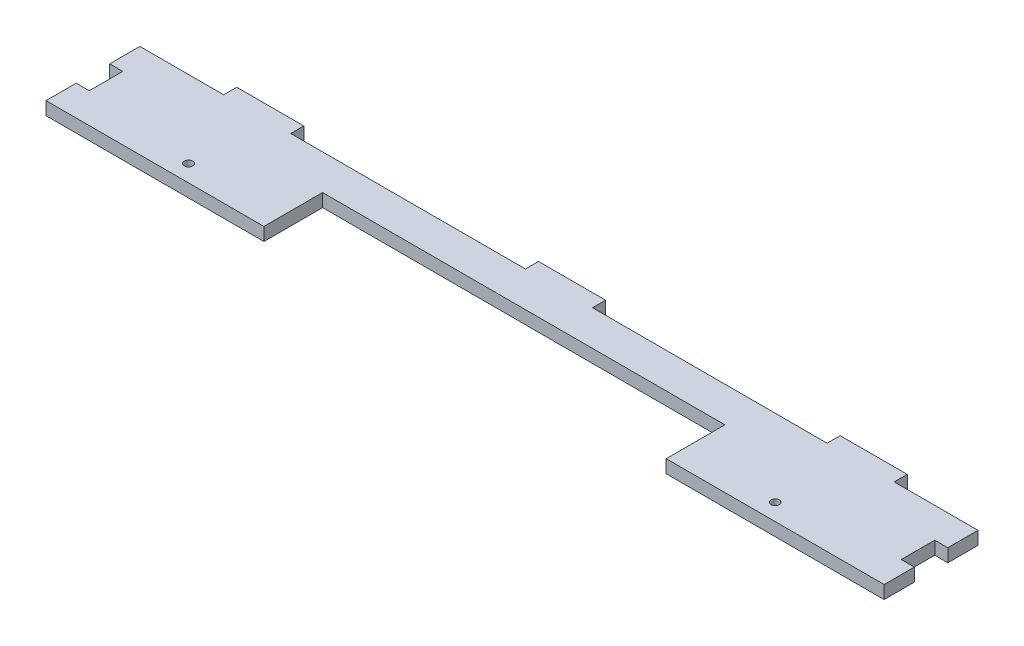
ISO-10303-21;
HEADER;
FILE_DESCRIPTION(('STEP AP214'),'2;1');
FILE_NAME('part.step','',(''),(''),'','','');
FILE_SCHEMA(('AUTOMOTIVE_DESIGN { 1 0 10303 214 1 1 1 1 }'));
ENDSEC;
DATA;
#1=APPLICATION_CONTEXT('core data for automotive mechanical design processes');
#2=APPLICATION_PROTOCOL_DEFINITION('international standard','automotive_design',2000,#1);
#3=PRODUCT_CONTEXT('',#1,'mechanical');
#4=PRODUCT('Part','Part','',(#3));
#5=PRODUCT_RELATED_PRODUCT_CATEGORY('part','',(#4));
#6=PRODUCT_DEFINITION_FORMATION('','',#4);
#7=PRODUCT_DEFINITION_CONTEXT('part definition',#1,'design');
#8=PRODUCT_DEFINITION('design','',#6,#7);
#9=PRODUCT_DEFINITION_SHAPE('','',#8);
#10=(LENGTH_UNIT() NAMED_UNIT(*) SI_UNIT(.MILLI.,.METRE.));
#11=(NAMED_UNIT(*) PLANE_ANGLE_UNIT() SI_UNIT($,.RADIAN.));
#12=(NAMED_UNIT(*) SI_UNIT($,.STERADIAN.) SOLID_ANGLE_UNIT());
#13=UNCERTAINTY_MEASURE_WITH_UNIT(LENGTH_MEASURE(1.E-05),#10,'distance_accuracy_value','');
#14=(GEOMETRIC_REPRESENTATION_CONTEXT(3) GLOBAL_UNCERTAINTY_ASSIGNED_CONTEXT((#13)) GLOBAL_UNIT_ASSIGNED_CONTEXT((#10,
#11,#12)) REPRESENTATION_CONTEXT('',''));
#15=CARTESIAN_POINT('',(0.,0.,0.));
#16=DIRECTION('',(0.,0.,1.));
#17=DIRECTION('',(1.,0.,0.));
#18=AXIS2_PLACEMENT_3D('',#15,#16,#17);
#19=CARTESIAN_POINT('',(60.,3.9,0.));
#20=DIRECTION('',(-1.,0.,0.));
#21=DIRECTION('',(0.,0.,1.));
#22=AXIS2_PLACEMENT_3D('',#19,#20,#21);
#23=PLANE('',#22);
#24=DIRECTION('',(0.,0.,-1.));
#25=VECTOR('',#24,1.);
#26=CARTESIAN_POINT('',(60.,0.,0.));
#27=LINE('',#26,#25);
#28=CARTESIAN_POINT('',(60.,0.,14.));
#29=VERTEX_POINT('',#28);
#30=CARTESIAN_POINT('',(60.,0.,-3.5));
#31=VERTEX_POINT('',#30);
#32=EDGE_CURVE('E270',#29,#31,#27,.T.);
#33=ORIENTED_EDGE('',*,*,#32,.F.);
#34=DIRECTION('',(0.,-1.,0.));
#35=VECTOR('',#34,1.);
#36=CARTESIAN_POINT('',(60.,3.9,14.));
#37=LINE('',#36,#35);
#38=CARTESIAN_POINT('',(60.,3.9,14.));
#39=VERTEX_POINT('',#38);
#40=EDGE_CURVE('E11',#39,#29,#37,.T.);
#41=ORIENTED_EDGE('',*,*,#40,.F.);
#42=DIRECTION('',(0.,0.,-1.));
#43=VECTOR('',#42,1.);
#44=CARTESIAN_POINT('',(60.,3.9,0.));
#45=LINE('',#44,#43);
#46=CARTESIAN_POINT('',(60.,3.9,-3.5));
#47=VERTEX_POINT('',#46);
#48=EDGE_CURVE('E379',#39,#47,#45,.T.);
#49=ORIENTED_EDGE('',*,*,#48,.T.);
#50=DIRECTION('',(0.,-1.,0.));
#51=VECTOR('',#50,1.);
#52=CARTESIAN_POINT('',(60.,3.9,-3.5));
#53=LINE('',#52,#51);
#54=EDGE_CURVE('E153',#47,#31,#53,.T.);
#55=ORIENTED_EDGE('',*,*,#54,.T.);
#56=EDGE_LOOP('',(#33,#41,#49,#55));
#57=FACE_BOUND('',#56,.T.);
#58=ADVANCED_FACE('F41',(#57),#23,.T.);
#59=CARTESIAN_POINT('',(0.,3.9,14.));
#60=DIRECTION('',(0.,0.,-1.));
#61=DIRECTION('',(-1.,0.,0.));
#62=AXIS2_PLACEMENT_3D('',#59,#60,#61);
#63=PLANE('',#62);
#64=DIRECTION('',(1.,0.,0.));
#65=VECTOR('',#64,1.);
#66=CARTESIAN_POINT('',(0.,0.,14.));
#67=LINE('',#66,#65);
#68=CARTESIAN_POINT('',(125.,0.,14.));
#69=VERTEX_POINT('',#68);
#70=EDGE_CURVE('E274',#29,#69,#67,.T.);
#71=ORIENTED_EDGE('',*,*,#70,.T.);
#72=DIRECTION('',(0.,-1.,0.));
#73=VECTOR('',#72,1.);
#74=CARTESIAN_POINT('',(125.,3.9,14.));
#75=LINE('',#74,#73);
#76=CARTESIAN_POINT('',(125.,3.9,14.));
#77=VERTEX_POINT('',#76);
#78=EDGE_CURVE('E50',#77,#69,#75,.T.);
#79=ORIENTED_EDGE('',*,*,#78,.F.);
#80=DIRECTION('',(1.,0.,0.));
#81=VECTOR('',#80,1.);
#82=CARTESIAN_POINT('',(0.,3.9,14.));
#83=LINE('',#82,#81);
#84=EDGE_CURVE('E245',#39,#77,#83,.T.);
#85=ORIENTED_EDGE('',*,*,#84,.F.);
#86=ORIENTED_EDGE('',*,*,#40,.T.);
#87=EDGE_LOOP('',(#71,#79,#85,#86));
#88=FACE_BOUND('',#87,.T.);
#89=ADVANCED_FACE('F464',(#88),#63,.F.);
#90=CARTESIAN_POINT('',(125.,3.9,7.70988211545248E-13));
#91=DIRECTION('',(1.,0.,0.));
#92=DIRECTION('',(0.,0.,-1.));
#93=AXIS2_PLACEMENT_3D('',#90,#91,#92);
#94=PLANE('',#93);
#95=DIRECTION('',(0.,0.,1.));
#96=VECTOR('',#95,1.);
#97=CARTESIAN_POINT('',(125.,0.,7.70988211545248E-13));
#98=LINE('',#97,#96);
#99=CARTESIAN_POINT('',(125.,0.,5.));
#100=VERTEX_POINT('',#99);
#101=EDGE_CURVE('E278',#100,#69,#98,.T.);
#102=ORIENTED_EDGE('',*,*,#101,.F.);
#103=DIRECTION('',(0.,-1.,0.));
#104=VECTOR('',#103,1.);
#105=CARTESIAN_POINT('',(125.,3.9,5.));
#106=LINE('',#105,#104);
#107=CARTESIAN_POINT('',(125.,3.9,5.));
#108=VERTEX_POINT('',#107);
#109=EDGE_CURVE('E452',#108,#100,#106,.T.);
#110=ORIENTED_EDGE('',*,*,#109,.F.);
#111=DIRECTION('',(0.,0.,1.));
#112=VECTOR('',#111,1.);
#113=CARTESIAN_POINT('',(125.,3.9,7.70988211545248E-13));
#114=LINE('',#113,#112);
#115=EDGE_CURVE('E461',#108,#77,#114,.T.);
#116=ORIENTED_EDGE('',*,*,#115,.T.);
#117=ORIENTED_EDGE('',*,*,#78,.T.);
#118=EDGE_LOOP('',(#102,#110,#116,#117));
#119=FACE_BOUND('',#118,.T.);
#120=ADVANCED_FACE('F459',(#119),#94,.T.);
#121=CARTESIAN_POINT('',(0.,3.9,4.99999999999997));
#122=DIRECTION('',(0.,0.,-1.));
#123=DIRECTION('',(-1.,0.,0.));
#124=AXIS2_PLACEMENT_3D('',#121,#122,#123);
#125=PLANE('',#124);
#126=DIRECTION('',(1.,0.,0.));
#127=VECTOR('',#126,1.);
#128=CARTESIAN_POINT('',(0.,0.,4.99999999999997));
#129=LINE('',#128,#127);
#130=CARTESIAN_POINT('',(121.1,0.,5.));
#131=VERTEX_POINT('',#130);
#132=EDGE_CURVE('E282',#131,#100,#129,.T.);
#133=ORIENTED_EDGE('',*,*,#132,.F.);
#134=DIRECTION('',(0.,-1.,0.));
#135=VECTOR('',#134,1.);
#136=CARTESIAN_POINT('',(121.1,3.9,5.));
#137=LINE('',#136,#135);
#138=CARTESIAN_POINT('',(121.1,3.9,5.));
#139=VERTEX_POINT('',#138);
#140=EDGE_CURVE('E449',#139,#131,#137,.T.);
#141=ORIENTED_EDGE('',*,*,#140,.F.);
#142=DIRECTION('',(1.,0.,0.));
#143=VECTOR('',#142,1.);
#144=CARTESIAN_POINT('',(0.,3.9,4.99999999999997));
#145=LINE('',#144,#143);
#146=EDGE_CURVE('E476',#139,#108,#145,.T.);
#147=ORIENTED_EDGE('',*,*,#146,.T.);
#148=ORIENTED_EDGE('',*,*,#109,.T.);
#149=EDGE_LOOP('',(#133,#141,#147,#148));
#150=FACE_BOUND('',#149,.T.);
#151=ADVANCED_FACE('F472',(#150),#125,.T.);
#152=CARTESIAN_POINT('',(121.1,3.9,0.));
#153=DIRECTION('',(-1.,0.,0.));
#154=DIRECTION('',(0.,0.,1.));
#155=AXIS2_PLACEMENT_3D('',#152,#153,#154);
#156=PLANE('',#155);
#157=DIRECTION('',(0.,0.,-1.));
#158=VECTOR('',#157,1.);
#159=CARTESIAN_POINT('',(121.1,0.,0.));
#160=LINE('',#159,#158);
#161=CARTESIAN_POINT('',(121.1,0.,-5.));
#162=VERTEX_POINT('',#161);
#163=EDGE_CURVE('E286',#131,#162,#160,.T.);
#164=ORIENTED_EDGE('',*,*,#163,.T.);
#165=DIRECTION('',(0.,-1.,0.));
#166=VECTOR('',#165,1.);
#167=CARTESIAN_POINT('',(121.1,3.9,-5.));
#168=LINE('',#167,#166);
#169=CARTESIAN_POINT('',(121.1,3.9,-5.));
#170=VERTEX_POINT('',#169);
#171=EDGE_CURVE('E445',#170,#162,#168,.T.);
#172=ORIENTED_EDGE('',*,*,#171,.F.);
#173=DIRECTION('',(0.,0.,-1.));
#174=VECTOR('',#173,1.);
#175=CARTESIAN_POINT('',(121.1,3.9,0.));
#176=LINE('',#175,#174);
#177=EDGE_CURVE('E481',#139,#170,#176,.T.);
#178=ORIENTED_EDGE('',*,*,#177,.F.);
#179=ORIENTED_EDGE('',*,*,#140,.T.);
#180=EDGE_LOOP('',(#164,#172,#178,#179));
#181=FACE_BOUND('',#180,.T.);
#182=ADVANCED_FACE('F660',(#181),#156,.F.);
#183=CARTESIAN_POINT('',(0.,3.9,-5.00000000000003));
#184=DIRECTION('',(0.,0.,-1.));
#185=DIRECTION('',(-1.,0.,0.));
#186=AXIS2_PLACEMENT_3D('',#183,#184,#185);
#187=PLANE('',#186);
#188=DIRECTION('',(1.,0.,0.));
#189=VECTOR('',#188,1.);
#190=CARTESIAN_POINT('',(0.,0.,-5.00000000000003));
#191=LINE('',#190,#189);
#192=CARTESIAN_POINT('',(125.,0.,-5.));
#193=VERTEX_POINT('',#192);
#194=EDGE_CURVE('E289',#162,#193,#191,.T.);
#195=ORIENTED_EDGE('',*,*,#194,.T.);
#196=DIRECTION('',(0.,-1.,0.));
#197=VECTOR('',#196,1.);
#198=CARTESIAN_POINT('',(125.,3.9,-5.));
#199=LINE('',#198,#197);
#200=CARTESIAN_POINT('',(125.,3.9,-5.));
#201=VERTEX_POINT('',#200);
#202=EDGE_CURVE('E442',#201,#193,#199,.T.);
#203=ORIENTED_EDGE('',*,*,#202,.F.);
#204=DIRECTION('',(1.,0.,0.));
#205=VECTOR('',#204,1.);
#206=CARTESIAN_POINT('',(0.,3.9,-5.00000000000003));
#207=LINE('',#206,#205);
#208=EDGE_CURVE('E487',#170,#201,#207,.T.);
#209=ORIENTED_EDGE('',*,*,#208,.F.);
#210=ORIENTED_EDGE('',*,*,#171,.T.);
#211=EDGE_LOOP('',(#195,#203,#209,#210));
#212=FACE_BOUND('',#211,.T.);
#213=ADVANCED_FACE('F656',(#212),#187,.F.);
#214=CARTESIAN_POINT('',(125.,3.9,-7.70988211545248E-13));
#215=DIRECTION('',(1.,0.,0.));
#216=DIRECTION('',(0.,0.,-1.));
#217=AXIS2_PLACEMENT_3D('',#214,#215,#216);
#218=PLANE('',#217);
#219=DIRECTION('',(0.,0.,1.));
#220=VECTOR('',#219,1.);
#221=CARTESIAN_POINT('',(125.,0.,-7.70988211545248E-13));
#222=LINE('',#221,#220);
#223=CARTESIAN_POINT('',(125.,0.,-14.));
#224=VERTEX_POINT('',#223);
#225=EDGE_CURVE('E293',#224,#193,#222,.T.);
#226=ORIENTED_EDGE('',*,*,#225,.F.);
#227=DIRECTION('',(0.,-1.,0.));
#228=VECTOR('',#227,1.);
#229=CARTESIAN_POINT('',(125.,3.9,-14.));
#230=LINE('',#229,#228);
#231=CARTESIAN_POINT('',(125.,3.9,-14.));
#232=VERTEX_POINT('',#231);
#233=EDGE_CURVE('E439',#232,#224,#230,.T.);
#234=ORIENTED_EDGE('',*,*,#233,.F.);
#235=DIRECTION('',(0.,0.,1.));
#236=VECTOR('',#235,1.);
#237=CARTESIAN_POINT('',(125.,3.9,-7.70988211545248E-13));
#238=LINE('',#237,#236);
#239=EDGE_CURVE('E490',#232,#201,#238,.T.);
#240=ORIENTED_EDGE('',*,*,#239,.T.);
#241=ORIENTED_EDGE('',*,*,#202,.T.);
#242=EDGE_LOOP('',(#226,#234,#240,#241));
#243=FACE_BOUND('',#242,.T.);
#244=ADVANCED_FACE('F652',(#243),#218,.T.);
#245=CARTESIAN_POINT('',(0.,3.9,-14.));
#246=DIRECTION('',(0.,0.,-1.));
#247=DIRECTION('',(-1.,0.,0.));
#248=AXIS2_PLACEMENT_3D('',#245,#246,#247);
#249=PLANE('',#248);
#250=DIRECTION('',(1.,0.,0.));
#251=VECTOR('',#250,1.);
#252=CARTESIAN_POINT('',(0.,0.,-14.));
#253=LINE('',#252,#251);
#254=CARTESIAN_POINT('',(100.,0.,-14.));
#255=VERTEX_POINT('',#254);
#256=EDGE_CURVE('E297',#255,#224,#253,.T.);
#257=ORIENTED_EDGE('',*,*,#256,.F.);
#258=DIRECTION('',(0.,-1.,0.));
#259=VECTOR('',#258,1.);
#260=CARTESIAN_POINT('',(100.,3.9,-14.));
#261=LINE('',#260,#259);
#262=CARTESIAN_POINT('',(100.,3.9,-14.));
#263=VERTEX_POINT('',#262);
#264=EDGE_CURVE('E436',#263,#255,#261,.T.);
#265=ORIENTED_EDGE('',*,*,#264,.F.);
#266=DIRECTION('',(1.,0.,0.));
#267=VECTOR('',#266,1.);
#268=CARTESIAN_POINT('',(0.,3.9,-14.));
#269=LINE('',#268,#267);
#270=EDGE_CURVE('E494',#263,#232,#269,.T.);
#271=ORIENTED_EDGE('',*,*,#270,.T.);
#272=ORIENTED_EDGE('',*,*,#233,.T.);
#273=EDGE_LOOP('',(#257,#265,#271,#272));
#274=FACE_BOUND('',#273,.T.);
#275=ADVANCED_FACE('F648',(#274),#249,.T.);
#276=CARTESIAN_POINT('',(100.,3.9,0.));
#277=DIRECTION('',(-1.,0.,0.));
#278=DIRECTION('',(0.,0.,1.));
#279=AXIS2_PLACEMENT_3D('',#276,#277,#278);
#280=PLANE('',#279);
#281=DIRECTION('',(0.,0.,-1.));
#282=VECTOR('',#281,1.);
#283=CARTESIAN_POINT('',(100.,0.,0.));
#284=LINE('',#283,#282);
#285=CARTESIAN_POINT('',(100.,0.,-17.9));
#286=VERTEX_POINT('',#285);
#287=EDGE_CURVE('E301',#255,#286,#284,.T.);
#288=ORIENTED_EDGE('',*,*,#287,.T.);
#289=DIRECTION('',(0.,-1.,0.));
#290=VECTOR('',#289,1.);
#291=CARTESIAN_POINT('',(100.,3.9,-17.9));
#292=LINE('',#291,#290);
#293=CARTESIAN_POINT('',(100.,3.9,-17.9));
#294=VERTEX_POINT('',#293);
#295=EDGE_CURVE('E432',#294,#286,#292,.T.);
#296=ORIENTED_EDGE('',*,*,#295,.F.);
#297=DIRECTION('',(0.,0.,-1.));
#298=VECTOR('',#297,1.);
#299=CARTESIAN_POINT('',(100.,3.9,0.));
#300=LINE('',#299,#298);
#301=EDGE_CURVE('E498',#263,#294,#300,.T.);
#302=ORIENTED_EDGE('',*,*,#301,.F.);
#303=ORIENTED_EDGE('',*,*,#264,.T.);
#304=EDGE_LOOP('',(#288,#296,#302,#303));
#305=FACE_BOUND('',#304,.T.);
#306=ADVANCED_FACE('F644',(#305),#280,.F.);
#307=CARTESIAN_POINT('',(0.,3.9,-17.9));
#308=DIRECTION('',(0.,0.,1.));
#309=DIRECTION('',(1.,0.,0.));
#310=AXIS2_PLACEMENT_3D('',#307,#308,#309);
#311=PLANE('',#310);
#312=DIRECTION('',(-1.,0.,0.));
#313=VECTOR('',#312,1.);
#314=CARTESIAN_POINT('',(0.,0.,-17.9));
#315=LINE('',#314,#313);
#316=CARTESIAN_POINT('',(80.,0.,-17.9));
#317=VERTEX_POINT('',#316);
#318=EDGE_CURVE('E304',#286,#317,#315,.T.);
#319=ORIENTED_EDGE('',*,*,#318,.T.);
#320=DIRECTION('',(0.,-1.,0.));
#321=VECTOR('',#320,1.);
#322=CARTESIAN_POINT('',(80.,3.9,-17.9));
#323=LINE('',#322,#321);
#324=CARTESIAN_POINT('',(80.,3.9,-17.9));
#325=VERTEX_POINT('',#324);
#326=EDGE_CURVE('E429',#325,#317,#323,.T.);
#327=ORIENTED_EDGE('',*,*,#326,.F.);
#328=DIRECTION('',(-1.,0.,0.));
#329=VECTOR('',#328,1.);
#330=CARTESIAN_POINT('',(0.,3.9,-17.9));
#331=LINE('',#330,#329);
#332=EDGE_CURVE('E501',#294,#325,#331,.T.);
#333=ORIENTED_EDGE('',*,*,#332,.F.);
#334=ORIENTED_EDGE('',*,*,#295,.T.);
#335=EDGE_LOOP('',(#319,#327,#333,#334));
#336=FACE_BOUND('',#335,.T.);
#337=ADVANCED_FACE('F640',(#336),#311,.F.);
#338=CARTESIAN_POINT('',(80.,3.9,0.));
#339=DIRECTION('',(-1.,0.,0.));
#340=DIRECTION('',(0.,0.,1.));
#341=AXIS2_PLACEMENT_3D('',#338,#339,#340);
#342=PLANE('',#341);
#343=DIRECTION('',(0.,0.,-1.));
#344=VECTOR('',#343,1.);
#345=CARTESIAN_POINT('',(80.,0.,0.));
#346=LINE('',#345,#344);
#347=CARTESIAN_POINT('',(80.,0.,-14.));
#348=VERTEX_POINT('',#347);
#349=EDGE_CURVE('E308',#348,#317,#346,.T.);
#350=ORIENTED_EDGE('',*,*,#349,.F.);
#351=DIRECTION('',(0.,-1.,0.));
#352=VECTOR('',#351,1.);
#353=CARTESIAN_POINT('',(80.,3.9,-14.));
#354=LINE('',#353,#352);
#355=CARTESIAN_POINT('',(80.,3.9,-14.));
#356=VERTEX_POINT('',#355);
#357=EDGE_CURVE('E426',#356,#348,#354,.T.);
#358=ORIENTED_EDGE('',*,*,#357,.F.);
#359=DIRECTION('',(0.,0.,-1.));
#360=VECTOR('',#359,1.);
#361=CARTESIAN_POINT('',(80.,3.9,0.));
#362=LINE('',#361,#360);
#363=EDGE_CURVE('E504',#356,#325,#362,.T.);
#364=ORIENTED_EDGE('',*,*,#363,.T.);
#365=ORIENTED_EDGE('',*,*,#326,.T.);
#366=EDGE_LOOP('',(#350,#358,#364,#365));
#367=FACE_BOUND('',#366,.T.);
#368=ADVANCED_FACE('F636',(#367),#342,.T.);
#369=CARTESIAN_POINT('',(0.,3.9,-14.));
#370=DIRECTION('',(0.,0.,-1.));
#371=DIRECTION('',(-1.,0.,0.));
#372=AXIS2_PLACEMENT_3D('',#369,#370,#371);
#373=PLANE('',#372);
#374=DIRECTION('',(1.,0.,0.));
#375=VECTOR('',#374,1.);
#376=CARTESIAN_POINT('',(0.,0.,-14.));
#377=LINE('',#376,#375);
#378=CARTESIAN_POINT('',(10.,0.,-14.));
#379=VERTEX_POINT('',#378);
#380=EDGE_CURVE('E312',#379,#348,#377,.T.);
#381=ORIENTED_EDGE('',*,*,#380,.F.);
#382=DIRECTION('',(0.,-1.,0.));
#383=VECTOR('',#382,1.);
#384=CARTESIAN_POINT('',(10.,3.9,-14.));
#385=LINE('',#384,#383);
#386=CARTESIAN_POINT('',(10.,3.9,-14.));
#387=VERTEX_POINT('',#386);
#388=EDGE_CURVE('E423',#387,#379,#385,.T.);
#389=ORIENTED_EDGE('',*,*,#388,.F.);
#390=DIRECTION('',(1.,0.,0.));
#391=VECTOR('',#390,1.);
#392=CARTESIAN_POINT('',(0.,3.9,-14.));
#393=LINE('',#392,#391);
#394=EDGE_CURVE('E508',#387,#356,#393,.T.);
#395=ORIENTED_EDGE('',*,*,#394,.T.);
#396=ORIENTED_EDGE('',*,*,#357,.T.);
#397=EDGE_LOOP('',(#381,#389,#395,#396));
#398=FACE_BOUND('',#397,.T.);
#399=ADVANCED_FACE('F632',(#398),#373,.T.);
#400=CARTESIAN_POINT('',(10.,3.9,0.));
#401=DIRECTION('',(1.,0.,0.));
#402=DIRECTION('',(0.,0.,-1.));
#403=AXIS2_PLACEMENT_3D('',#400,#401,#402);
#404=PLANE('',#403);
#405=DIRECTION('',(0.,0.,1.));
#406=VECTOR('',#405,1.);
#407=CARTESIAN_POINT('',(10.,0.,0.));
#408=LINE('',#407,#406);
#409=CARTESIAN_POINT('',(10.,0.,-17.9));
#410=VERTEX_POINT('',#409);
#411=EDGE_CURVE('E316',#410,#379,#408,.T.);
#412=ORIENTED_EDGE('',*,*,#411,.F.);
#413=DIRECTION('',(0.,-1.,0.));
#414=VECTOR('',#413,1.);
#415=CARTESIAN_POINT('',(10.,3.9,-17.9));
#416=LINE('',#415,#414);
#417=CARTESIAN_POINT('',(10.,3.9,-17.9));
#418=VERTEX_POINT('',#417);
#419=EDGE_CURVE('E420',#418,#410,#416,.T.);
#420=ORIENTED_EDGE('',*,*,#419,.F.);
#421=DIRECTION('',(0.,0.,1.));
#422=VECTOR('',#421,1.);
#423=CARTESIAN_POINT('',(10.,3.9,0.));
#424=LINE('',#423,#422);
#425=EDGE_CURVE('E512',#418,#387,#424,.T.);
#426=ORIENTED_EDGE('',*,*,#425,.T.);
#427=ORIENTED_EDGE('',*,*,#388,.T.);
#428=EDGE_LOOP('',(#412,#420,#426,#427));
#429=FACE_BOUND('',#428,.T.);
#430=ADVANCED_FACE('F628',(#429),#404,.T.);
#431=CARTESIAN_POINT('',(0.,3.9,-17.9));
#432=DIRECTION('',(0.,0.,-1.));
#433=DIRECTION('',(-1.,0.,0.));
#434=AXIS2_PLACEMENT_3D('',#431,#432,#433);
#435=PLANE('',#434);
#436=DIRECTION('',(1.,0.,0.));
#437=VECTOR('',#436,1.);
#438=CARTESIAN_POINT('',(0.,0.,-17.9));
#439=LINE('',#438,#437);
#440=CARTESIAN_POINT('',(-10.,0.,-17.9));
#441=VERTEX_POINT('',#440);
#442=EDGE_CURVE('E320',#441,#410,#439,.T.);
#443=ORIENTED_EDGE('',*,*,#442,.F.);
#444=DIRECTION('',(0.,-1.,0.));
#445=VECTOR('',#444,1.);
#446=CARTESIAN_POINT('',(-10.,3.9,-17.9));
#447=LINE('',#446,#445);
#448=CARTESIAN_POINT('',(-10.,3.9,-17.9));
#449=VERTEX_POINT('',#448);
#450=EDGE_CURVE('E417',#449,#441,#447,.T.);
#451=ORIENTED_EDGE('',*,*,#450,.F.);
#452=DIRECTION('',(1.,0.,0.));
#453=VECTOR('',#452,1.);
#454=CARTESIAN_POINT('',(0.,3.9,-17.9));
#455=LINE('',#454,#453);
#456=EDGE_CURVE('E516',#449,#418,#455,.T.);
#457=ORIENTED_EDGE('',*,*,#456,.T.);
#458=ORIENTED_EDGE('',*,*,#419,.T.);
#459=EDGE_LOOP('',(#443,#451,#457,#458));
#460=FACE_BOUND('',#459,.T.);
#461=ADVANCED_FACE('F624',(#460),#435,.T.);
#462=CARTESIAN_POINT('',(-10.,3.9,0.));
#463=DIRECTION('',(1.,0.,0.));
#464=DIRECTION('',(0.,0.,-1.));
#465=AXIS2_PLACEMENT_3D('',#462,#463,#464);
#466=PLANE('',#465);
#467=DIRECTION('',(0.,0.,1.));
#468=VECTOR('',#467,1.);
#469=CARTESIAN_POINT('',(-10.,0.,0.));
#470=LINE('',#469,#468);
#471=CARTESIAN_POINT('',(-10.,0.,-14.));
#472=VERTEX_POINT('',#471);
#473=EDGE_CURVE('E324',#441,#472,#470,.T.);
#474=ORIENTED_EDGE('',*,*,#473,.T.);
#475=DIRECTION('',(0.,-1.,0.));
#476=VECTOR('',#475,1.);
#477=CARTESIAN_POINT('',(-10.,3.9,-14.));
#478=LINE('',#477,#476);
#479=CARTESIAN_POINT('',(-10.,3.9,-14.));
#480=VERTEX_POINT('',#479);
#481=EDGE_CURVE('E414',#480,#472,#478,.T.);
#482=ORIENTED_EDGE('',*,*,#481,.F.);
#483=DIRECTION('',(0.,0.,1.));
#484=VECTOR('',#483,1.);
#485=CARTESIAN_POINT('',(-10.,3.9,0.));
#486=LINE('',#485,#484);
#487=EDGE_CURVE('E520',#449,#480,#486,.T.);
#488=ORIENTED_EDGE('',*,*,#487,.F.);
#489=ORIENTED_EDGE('',*,*,#450,.T.);
#490=EDGE_LOOP('',(#474,#482,#488,#489));
#491=FACE_BOUND('',#490,.T.);
#492=ADVANCED_FACE('F620',(#491),#466,.F.);
#493=CARTESIAN_POINT('',(0.,3.9,-14.));
#494=DIRECTION('',(0.,0.,-1.));
#495=DIRECTION('',(-1.,0.,0.));
#496=AXIS2_PLACEMENT_3D('',#493,#494,#495);
#497=PLANE('',#496);
#498=DIRECTION('',(1.,0.,0.));
#499=VECTOR('',#498,1.);
#500=CARTESIAN_POINT('',(0.,0.,-14.));
#501=LINE('',#500,#499);
#502=CARTESIAN_POINT('',(-80.,0.,-14.));
#503=VERTEX_POINT('',#502);
#504=EDGE_CURVE('E328',#503,#472,#501,.T.);
#505=ORIENTED_EDGE('',*,*,#504,.F.);
#506=DIRECTION('',(0.,-1.,0.));
#507=VECTOR('',#506,1.);
#508=CARTESIAN_POINT('',(-80.,3.9,-14.));
#509=LINE('',#508,#507);
#510=CARTESIAN_POINT('',(-80.,3.9,-14.));
#511=VERTEX_POINT('',#510);
#512=EDGE_CURVE('E411',#511,#503,#509,.T.);
#513=ORIENTED_EDGE('',*,*,#512,.F.);
#514=DIRECTION('',(1.,0.,0.));
#515=VECTOR('',#514,1.);
#516=CARTESIAN_POINT('',(0.,3.9,-14.));
#517=LINE('',#516,#515);
#518=EDGE_CURVE('E523',#511,#480,#517,.T.);
#519=ORIENTED_EDGE('',*,*,#518,.T.);
#520=ORIENTED_EDGE('',*,*,#481,.T.);
#521=EDGE_LOOP('',(#505,#513,#519,#520));
#522=FACE_BOUND('',#521,.T.);
#523=ADVANCED_FACE('F616',(#522),#497,.T.);
#524=CARTESIAN_POINT('',(-80.,3.9,0.));
#525=DIRECTION('',(-1.,0.,0.));
#526=DIRECTION('',(0.,0.,1.));
#527=AXIS2_PLACEMENT_3D('',#524,#525,#526);
#528=PLANE('',#527);
#529=DIRECTION('',(0.,0.,-1.));
#530=VECTOR('',#529,1.);
#531=CARTESIAN_POINT('',(-80.,0.,0.));
#532=LINE('',#531,#530);
#533=CARTESIAN_POINT('',(-80.,0.,-17.9));
#534=VERTEX_POINT('',#533);
#535=EDGE_CURVE('E332',#503,#534,#532,.T.);
#536=ORIENTED_EDGE('',*,*,#535,.T.);
#537=DIRECTION('',(0.,-1.,0.));
#538=VECTOR('',#537,1.);
#539=CARTESIAN_POINT('',(-80.,3.9,-17.9));
#540=LINE('',#539,#538);
#541=CARTESIAN_POINT('',(-80.,3.9,-17.9));
#542=VERTEX_POINT('',#541);
#543=EDGE_CURVE('E408',#542,#534,#540,.T.);
#544=ORIENTED_EDGE('',*,*,#543,.F.);
#545=DIRECTION('',(0.,0.,-1.));
#546=VECTOR('',#545,1.);
#547=CARTESIAN_POINT('',(-80.,3.9,0.));
#548=LINE('',#547,#546);
#549=EDGE_CURVE('E527',#511,#542,#548,.T.);
#550=ORIENTED_EDGE('',*,*,#549,.F.);
#551=ORIENTED_EDGE('',*,*,#512,.T.);
#552=EDGE_LOOP('',(#536,#544,#550,#551));
#553=FACE_BOUND('',#552,.T.);
#554=ADVANCED_FACE('F612',(#553),#528,.F.);
#555=CARTESIAN_POINT('',(0.,3.9,-17.9));
#556=DIRECTION('',(0.,0.,-1.));
#557=DIRECTION('',(-1.,0.,0.));
#558=AXIS2_PLACEMENT_3D('',#555,#556,#557);
#559=PLANE('',#558);
#560=DIRECTION('',(1.,0.,0.));
#561=VECTOR('',#560,1.);
#562=CARTESIAN_POINT('',(0.,0.,-17.9));
#563=LINE('',#562,#561);
#564=CARTESIAN_POINT('',(-100.,0.,-17.9));
#565=VERTEX_POINT('',#564);
#566=EDGE_CURVE('E336',#565,#534,#563,.T.);
#567=ORIENTED_EDGE('',*,*,#566,.F.);
#568=DIRECTION('',(0.,-1.,0.));
#569=VECTOR('',#568,1.);
#570=CARTESIAN_POINT('',(-100.,3.9,-17.9));
#571=LINE('',#570,#569);
#572=CARTESIAN_POINT('',(-100.,3.9,-17.9));
#573=VERTEX_POINT('',#572);
#574=EDGE_CURVE('E405',#573,#565,#571,.T.);
#575=ORIENTED_EDGE('',*,*,#574,.F.);
#576=DIRECTION('',(1.,0.,0.));
#577=VECTOR('',#576,1.);
#578=CARTESIAN_POINT('',(0.,3.9,-17.9));
#579=LINE('',#578,#577);
#580=EDGE_CURVE('E530',#573,#542,#579,.T.);
#581=ORIENTED_EDGE('',*,*,#580,.T.);
#582=ORIENTED_EDGE('',*,*,#543,.T.);
#583=EDGE_LOOP('',(#567,#575,#581,#582));
#584=FACE_BOUND('',#583,.T.);
#585=ADVANCED_FACE('F608',(#584),#559,.T.);
#586=CARTESIAN_POINT('',(-100.,3.9,0.));
#587=DIRECTION('',(-1.,0.,0.));
#588=DIRECTION('',(0.,0.,1.));
#589=AXIS2_PLACEMENT_3D('',#586,#587,#588);
#590=PLANE('',#589);
#591=DIRECTION('',(0.,0.,-1.));
#592=VECTOR('',#591,1.);
#593=CARTESIAN_POINT('',(-100.,0.,0.));
#594=LINE('',#593,#592);
#595=CARTESIAN_POINT('',(-100.,0.,-14.));
#596=VERTEX_POINT('',#595);
#597=EDGE_CURVE('E340',#596,#565,#594,.T.);
#598=ORIENTED_EDGE('',*,*,#597,.F.);
#599=DIRECTION('',(0.,-1.,0.));
#600=VECTOR('',#599,1.);
#601=CARTESIAN_POINT('',(-100.,3.9,-14.));
#602=LINE('',#601,#600);
#603=CARTESIAN_POINT('',(-100.,3.9,-14.));
#604=VERTEX_POINT('',#603);
#605=EDGE_CURVE('E402',#604,#596,#602,.T.);
#606=ORIENTED_EDGE('',*,*,#605,.F.);
#607=DIRECTION('',(0.,0.,-1.));
#608=VECTOR('',#607,1.);
#609=CARTESIAN_POINT('',(-100.,3.9,0.));
#610=LINE('',#609,#608);
#611=EDGE_CURVE('E534',#604,#573,#610,.T.);
#612=ORIENTED_EDGE('',*,*,#611,.T.);
#613=ORIENTED_EDGE('',*,*,#574,.T.);
#614=EDGE_LOOP('',(#598,#606,#612,#613));
#615=FACE_BOUND('',#614,.T.);
#616=ADVANCED_FACE('F604',(#615),#590,.T.);
#617=CARTESIAN_POINT('',(0.,3.9,-14.));
#618=DIRECTION('',(0.,0.,-1.));
#619=DIRECTION('',(-1.,0.,0.));
#620=AXIS2_PLACEMENT_3D('',#617,#618,#619);
#621=PLANE('',#620);
#622=DIRECTION('',(1.,0.,0.));
#623=VECTOR('',#622,1.);
#624=CARTESIAN_POINT('',(0.,0.,-14.));
#625=LINE('',#624,#623);
#626=CARTESIAN_POINT('',(-125.,0.,-14.));
#627=VERTEX_POINT('',#626);
#628=EDGE_CURVE('E344',#627,#596,#625,.T.);
#629=ORIENTED_EDGE('',*,*,#628,.F.);
#630=DIRECTION('',(0.,-1.,0.));
#631=VECTOR('',#630,1.);
#632=CARTESIAN_POINT('',(-125.,3.9,-14.));
#633=LINE('',#632,#631);
#634=CARTESIAN_POINT('',(-125.,3.9,-14.));
#635=VERTEX_POINT('',#634);
#636=EDGE_CURVE('E399',#635,#627,#633,.T.);
#637=ORIENTED_EDGE('',*,*,#636,.F.);
#638=DIRECTION('',(1.,0.,0.));
#639=VECTOR('',#638,1.);
#640=CARTESIAN_POINT('',(0.,3.9,-14.));
#641=LINE('',#640,#639);
#642=EDGE_CURVE('E538',#635,#604,#641,.T.);
#643=ORIENTED_EDGE('',*,*,#642,.T.);
#644=ORIENTED_EDGE('',*,*,#605,.T.);
#645=EDGE_LOOP('',(#629,#637,#643,#644));
#646=FACE_BOUND('',#645,.T.);
#647=ADVANCED_FACE('F600',(#646),#621,.T.);
#648=CARTESIAN_POINT('',(-125.,3.9,0.));
#649=DIRECTION('',(1.,0.,0.));
#650=DIRECTION('',(0.,0.,-1.));
#651=AXIS2_PLACEMENT_3D('',#648,#649,#650);
#652=PLANE('',#651);
#653=DIRECTION('',(0.,0.,1.));
#654=VECTOR('',#653,1.);
#655=CARTESIAN_POINT('',(-125.,0.,0.));
#656=LINE('',#655,#654);
#657=CARTESIAN_POINT('',(-125.,0.,-5.));
#658=VERTEX_POINT('',#657);
#659=EDGE_CURVE('E348',#627,#658,#656,.T.);
#660=ORIENTED_EDGE('',*,*,#659,.T.);
#661=DIRECTION('',(0.,-1.,0.));
#662=VECTOR('',#661,1.);
#663=CARTESIAN_POINT('',(-125.,3.9,-5.));
#664=LINE('',#663,#662);
#665=CARTESIAN_POINT('',(-125.,3.9,-5.));
#666=VERTEX_POINT('',#665);
#667=EDGE_CURVE('E396',#666,#658,#664,.T.);
#668=ORIENTED_EDGE('',*,*,#667,.F.);
#669=DIRECTION('',(0.,0.,1.));
#670=VECTOR('',#669,1.);
#671=CARTESIAN_POINT('',(-125.,3.9,0.));
#672=LINE('',#671,#670);
#673=EDGE_CURVE('E542',#635,#666,#672,.T.);
#674=ORIENTED_EDGE('',*,*,#673,.F.);
#675=ORIENTED_EDGE('',*,*,#636,.T.);
#676=EDGE_LOOP('',(#660,#668,#674,#675));
#677=FACE_BOUND('',#676,.T.);
#678=ADVANCED_FACE('F596',(#677),#652,.F.);
#679=CARTESIAN_POINT('',(0.,3.9,-5.00000000000003));
#680=DIRECTION('',(0.,0.,1.));
#681=DIRECTION('',(1.,0.,0.));
#682=AXIS2_PLACEMENT_3D('',#679,#680,#681);
#683=PLANE('',#682);
#684=DIRECTION('',(-1.,0.,0.));
#685=VECTOR('',#684,1.);
#686=CARTESIAN_POINT('',(0.,0.,-5.00000000000003));
#687=LINE('',#686,#685);
#688=CARTESIAN_POINT('',(-121.1,0.,-5.));
#689=VERTEX_POINT('',#688);
#690=EDGE_CURVE('E352',#689,#658,#687,.T.);
#691=ORIENTED_EDGE('',*,*,#690,.F.);
#692=DIRECTION('',(0.,-1.,0.));
#693=VECTOR('',#692,1.);
#694=CARTESIAN_POINT('',(-121.1,3.9,-5.));
#695=LINE('',#694,#693);
#696=CARTESIAN_POINT('',(-121.1,3.9,-5.));
#697=VERTEX_POINT('',#696);
#698=EDGE_CURVE('E393',#697,#689,#695,.T.);
#699=ORIENTED_EDGE('',*,*,#698,.F.);
#700=DIRECTION('',(-1.,0.,0.));
#701=VECTOR('',#700,1.);
#702=CARTESIAN_POINT('',(0.,3.9,-5.00000000000003));
#703=LINE('',#702,#701);
#704=EDGE_CURVE('E545',#697,#666,#703,.T.);
#705=ORIENTED_EDGE('',*,*,#704,.T.);
#706=ORIENTED_EDGE('',*,*,#667,.T.);
#707=EDGE_LOOP('',(#691,#699,#705,#706));
#708=FACE_BOUND('',#707,.T.);
#709=ADVANCED_FACE('F592',(#708),#683,.T.);
#710=CARTESIAN_POINT('',(-121.1,3.9,0.));
#711=DIRECTION('',(-1.,0.,0.));
#712=DIRECTION('',(0.,0.,1.));
#713=AXIS2_PLACEMENT_3D('',#710,#711,#712);
#714=PLANE('',#713);
#715=DIRECTION('',(0.,0.,-1.));
#716=VECTOR('',#715,1.);
#717=CARTESIAN_POINT('',(-121.1,0.,0.));
#718=LINE('',#717,#716);
#719=CARTESIAN_POINT('',(-121.1,0.,5.));
#720=VERTEX_POINT('',#719);
#721=EDGE_CURVE('E356',#720,#689,#718,.T.);
#722=ORIENTED_EDGE('',*,*,#721,.F.);
#723=DIRECTION('',(0.,-1.,0.));
#724=VECTOR('',#723,1.);
#725=CARTESIAN_POINT('',(-121.1,3.9,5.));
#726=LINE('',#725,#724);
#727=CARTESIAN_POINT('',(-121.1,3.9,5.));
#728=VERTEX_POINT('',#727);
#729=EDGE_CURVE('E390',#728,#720,#726,.T.);
#730=ORIENTED_EDGE('',*,*,#729,.F.);
#731=DIRECTION('',(0.,0.,-1.));
#732=VECTOR('',#731,1.);
#733=CARTESIAN_POINT('',(-121.1,3.9,0.));
#734=LINE('',#733,#732);
#735=EDGE_CURVE('E549',#728,#697,#734,.T.);
#736=ORIENTED_EDGE('',*,*,#735,.T.);
#737=ORIENTED_EDGE('',*,*,#698,.T.);
#738=EDGE_LOOP('',(#722,#730,#736,#737));
#739=FACE_BOUND('',#738,.T.);
#740=ADVANCED_FACE('F587',(#739),#714,.T.);
#741=CARTESIAN_POINT('',(0.,3.9,4.99999999999997));
#742=DIRECTION('',(0.,0.,1.));
#743=DIRECTION('',(1.,0.,0.));
#744=AXIS2_PLACEMENT_3D('',#741,#742,#743);
#745=PLANE('',#744);
#746=DIRECTION('',(-1.,0.,0.));
#747=VECTOR('',#746,1.);
#748=CARTESIAN_POINT('',(0.,0.,4.99999999999997));
#749=LINE('',#748,#747);
#750=CARTESIAN_POINT('',(-125.,0.,5.));
#751=VERTEX_POINT('',#750);
#752=EDGE_CURVE('E360',#720,#751,#749,.T.);
#753=ORIENTED_EDGE('',*,*,#752,.T.);
#754=DIRECTION('',(0.,-1.,0.));
#755=VECTOR('',#754,1.);
#756=CARTESIAN_POINT('',(-125.,3.9,5.));
#757=LINE('',#756,#755);
#758=CARTESIAN_POINT('',(-125.,3.9,5.));
#759=VERTEX_POINT('',#758);
#760=EDGE_CURVE('E386',#759,#751,#757,.T.);
#761=ORIENTED_EDGE('',*,*,#760,.F.);
#762=DIRECTION('',(-1.,0.,0.));
#763=VECTOR('',#762,1.);
#764=CARTESIAN_POINT('',(0.,3.9,4.99999999999997));
#765=LINE('',#764,#763);
#766=EDGE_CURVE('E552',#728,#759,#765,.T.);
#767=ORIENTED_EDGE('',*,*,#766,.F.);
#768=ORIENTED_EDGE('',*,*,#729,.T.);
#769=EDGE_LOOP('',(#753,#761,#767,#768));
#770=FACE_BOUND('',#769,.T.);
#771=ADVANCED_FACE('F560',(#770),#745,.F.);
#772=CARTESIAN_POINT('',(-125.,3.9,0.));
#773=DIRECTION('',(1.,0.,0.));
#774=DIRECTION('',(0.,0.,-1.));
#775=AXIS2_PLACEMENT_3D('',#772,#773,#774);
#776=PLANE('',#775);
#777=DIRECTION('',(0.,0.,1.));
#778=VECTOR('',#777,1.);
#779=CARTESIAN_POINT('',(-125.,0.,0.));
#780=LINE('',#779,#778);
#781=CARTESIAN_POINT('',(-125.,0.,14.));
#782=VERTEX_POINT('',#781);
#783=EDGE_CURVE('E363',#751,#782,#780,.T.);
#784=ORIENTED_EDGE('',*,*,#783,.T.);
#785=DIRECTION('',(0.,-1.,0.));
#786=VECTOR('',#785,1.);
#787=CARTESIAN_POINT('',(-125.,3.9,14.));
#788=LINE('',#787,#786);
#789=CARTESIAN_POINT('',(-125.,3.9,14.));
#790=VERTEX_POINT('',#789);
#791=EDGE_CURVE('E251',#790,#782,#788,.T.);
#792=ORIENTED_EDGE('',*,*,#791,.F.);
#793=DIRECTION('',(0.,0.,1.));
#794=VECTOR('',#793,1.);
#795=CARTESIAN_POINT('',(-125.,3.9,0.));
#796=LINE('',#795,#794);
#797=EDGE_CURVE('E239',#759,#790,#796,.T.);
#798=ORIENTED_EDGE('',*,*,#797,.F.);
#799=ORIENTED_EDGE('',*,*,#760,.T.);
#800=EDGE_LOOP('',(#784,#792,#798,#799));
#801=FACE_BOUND('',#800,.T.);
#802=ADVANCED_FACE('F564',(#801),#776,.F.);
#803=CARTESIAN_POINT('',(-60.,0.,14.));
#804=VERTEX_POINT('',#803);
#805=EDGE_CURVE('E249',#782,#804,#67,.T.);
#806=ORIENTED_EDGE('',*,*,#805,.T.);
#807=DIRECTION('',(0.,-1.,0.));
#808=VECTOR('',#807,1.);
#809=CARTESIAN_POINT('',(-60.,3.9,14.));
#810=LINE('',#809,#808);
#811=CARTESIAN_POINT('',(-60.,3.9,14.));
#812=VERTEX_POINT('',#811);
#813=EDGE_CURVE('E246',#812,#804,#810,.T.);
#814=ORIENTED_EDGE('',*,*,#813,.F.);
#815=EDGE_CURVE('E232',#790,#812,#83,.T.);
#816=ORIENTED_EDGE('',*,*,#815,.F.);
#817=ORIENTED_EDGE('',*,*,#791,.T.);
#818=EDGE_LOOP('',(#806,#814,#816,#817));
#819=FACE_BOUND('',#818,.T.);
#820=ADVANCED_FACE('F247',(#819),#63,.F.);
#821=CARTESIAN_POINT('',(-60.,3.9,0.));
#822=DIRECTION('',(-1.,0.,0.));
#823=DIRECTION('',(0.,0.,1.));
#824=AXIS2_PLACEMENT_3D('',#821,#822,#823);
#825=PLANE('',#824);
#826=DIRECTION('',(0.,0.,-1.));
#827=VECTOR('',#826,1.);
#828=CARTESIAN_POINT('',(-60.,0.,0.));
#829=LINE('',#828,#827);
#830=CARTESIAN_POINT('',(-60.,0.,-3.5));
#831=VERTEX_POINT('',#830);
#832=EDGE_CURVE('E146',#804,#831,#829,.T.);
#833=ORIENTED_EDGE('',*,*,#832,.T.);
#834=DIRECTION('',(0.,-1.,0.));
#835=VECTOR('',#834,1.);
#836=CARTESIAN_POINT('',(-60.,3.9,-3.5));
#837=LINE('',#836,#835);
#838=CARTESIAN_POINT('',(-60.,3.9,-3.5));
#839=VERTEX_POINT('',#838);
#840=EDGE_CURVE('E252',#839,#831,#837,.T.);
#841=ORIENTED_EDGE('',*,*,#840,.F.);
#842=DIRECTION('',(0.,0.,-1.));
#843=VECTOR('',#842,1.);
#844=CARTESIAN_POINT('',(-60.,3.9,0.));
#845=LINE('',#844,#843);
#846=EDGE_CURVE('E237',#812,#839,#845,.T.);
#847=ORIENTED_EDGE('',*,*,#846,.F.);
#848=ORIENTED_EDGE('',*,*,#813,.T.);
#849=EDGE_LOOP('',(#833,#841,#847,#848));
#850=FACE_BOUND('',#849,.T.);
#851=ADVANCED_FACE('F254',(#850),#825,.F.);
#852=CARTESIAN_POINT('',(-87.5,3.9,9.));
#853=DIRECTION('',(0.,-1.,0.));
#854=DIRECTION('',(0.,0.,-1.));
#855=AXIS2_PLACEMENT_3D('',#852,#853,#854);
#856=CYLINDRICAL_SURFACE('',#855,1.25);
#857=CARTESIAN_POINT('',(-87.5,3.9,9.));
#858=DIRECTION('',(0.,1.,0.));
#859=DIRECTION('',(0.,0.,1.));
#860=AXIS2_PLACEMENT_3D('',#857,#858,#859);
#861=CIRCLE('',#860,1.25);
#862=CARTESIAN_POINT('',(-87.5,3.9,10.25));
#863=VERTEX_POINT('',#862);
#864=EDGE_CURVE('E258',#863,#863,#861,.T.);
#865=ORIENTED_EDGE('',*,*,#864,.T.);
#866=EDGE_LOOP('',(#865));
#867=FACE_BOUND('',#866,.T.);
#868=CARTESIAN_POINT('',(-87.5,0.,9.));
#869=DIRECTION('',(0.,1.,0.));
#870=DIRECTION('',(0.,0.,1.));
#871=AXIS2_PLACEMENT_3D('',#868,#869,#870);
#872=CIRCLE('',#871,1.25);
#873=CARTESIAN_POINT('',(-87.5,0.,10.25));
#874=VERTEX_POINT('',#873);
#875=EDGE_CURVE('E371',#874,#874,#872,.T.);
#876=ORIENTED_EDGE('',*,*,#875,.F.);
#877=EDGE_LOOP('',(#876));
#878=FACE_BOUND('',#877,.T.);
#879=ADVANCED_FACE('F583',(#867,#878),#856,.F.);
#880=CARTESIAN_POINT('',(0.,3.9,-3.5));
#881=DIRECTION('',(0.,0.,-1.));
#882=DIRECTION('',(-1.,0.,0.));
#883=AXIS2_PLACEMENT_3D('',#880,#881,#882);
#884=PLANE('',#883);
#885=DIRECTION('',(1.,0.,0.));
#886=VECTOR('',#885,1.);
#887=CARTESIAN_POINT('',(0.,0.,-3.5));
#888=LINE('',#887,#886);
#889=EDGE_CURVE('E368',#831,#31,#888,.T.);
#890=ORIENTED_EDGE('',*,*,#889,.T.);
#891=ORIENTED_EDGE('',*,*,#54,.F.);
#892=DIRECTION('',(1.,0.,0.));
#893=VECTOR('',#892,1.);
#894=CARTESIAN_POINT('',(0.,3.9,-3.5));
#895=LINE('',#894,#893);
#896=EDGE_CURVE('E58',#839,#47,#895,.T.);
#897=ORIENTED_EDGE('',*,*,#896,.F.);
#898=ORIENTED_EDGE('',*,*,#840,.T.);
#899=EDGE_LOOP('',(#890,#891,#897,#898));
#900=FACE_BOUND('',#899,.T.);
#901=ADVANCED_FACE('F773',(#900),#884,.F.);
#902=CARTESIAN_POINT('',(87.5,3.9,9.));
#903=DIRECTION('',(0.,-1.,0.));
#904=DIRECTION('',(0.,0.,-1.));
#905=AXIS2_PLACEMENT_3D('',#902,#903,#904);
#906=CYLINDRICAL_SURFACE('',#905,1.25);
#907=CARTESIAN_POINT('',(87.5,3.9,9.));
#908=DIRECTION('',(0.,1.,0.));
#909=DIRECTION('',(0.,0.,1.));
#910=AXIS2_PLACEMENT_3D('',#907,#908,#909);
#911=CIRCLE('',#910,1.25);
#912=CARTESIAN_POINT('',(87.5,3.9,10.25));
#913=VERTEX_POINT('',#912);
#914=EDGE_CURVE('E266',#913,#913,#911,.F.);
#915=ORIENTED_EDGE('',*,*,#914,.F.);
#916=EDGE_LOOP('',(#915));
#917=FACE_BOUND('',#916,.T.);
#918=CARTESIAN_POINT('',(87.5,0.,9.));
#919=DIRECTION('',(0.,1.,0.));
#920=DIRECTION('',(0.,0.,1.));
#921=AXIS2_PLACEMENT_3D('',#918,#919,#920);
#922=CIRCLE('',#921,1.25);
#923=CARTESIAN_POINT('',(87.5,0.,10.25));
#924=VERTEX_POINT('',#923);
#925=EDGE_CURVE('E375',#924,#924,#922,.F.);
#926=ORIENTED_EDGE('',*,*,#925,.T.);
#927=EDGE_LOOP('',(#926));
#928=FACE_BOUND('',#927,.T.);
#929=ADVANCED_FACE('F783',(#917,#928),#906,.F.);
#930=CARTESIAN_POINT('',(0.,3.9,0.));
#931=DIRECTION('',(0.,1.,0.));
#932=DIRECTION('',(0.,0.,1.));
#933=AXIS2_PLACEMENT_3D('',#930,#931,#932);
#934=PLANE('',#933);
#935=ORIENTED_EDGE('',*,*,#48,.F.);
#936=ORIENTED_EDGE('',*,*,#84,.T.);
#937=ORIENTED_EDGE('',*,*,#115,.F.);
#938=ORIENTED_EDGE('',*,*,#146,.F.);
#939=ORIENTED_EDGE('',*,*,#177,.T.);
#940=ORIENTED_EDGE('',*,*,#208,.T.);
#941=ORIENTED_EDGE('',*,*,#239,.F.);
#942=ORIENTED_EDGE('',*,*,#270,.F.);
#943=ORIENTED_EDGE('',*,*,#301,.T.);
#944=ORIENTED_EDGE('',*,*,#332,.T.);
#945=ORIENTED_EDGE('',*,*,#363,.F.);
#946=ORIENTED_EDGE('',*,*,#394,.F.);
#947=ORIENTED_EDGE('',*,*,#425,.F.);
#948=ORIENTED_EDGE('',*,*,#456,.F.);
#949=ORIENTED_EDGE('',*,*,#487,.T.);
#950=ORIENTED_EDGE('',*,*,#518,.F.);
#951=ORIENTED_EDGE('',*,*,#549,.T.);
#952=ORIENTED_EDGE('',*,*,#580,.F.);
#953=ORIENTED_EDGE('',*,*,#611,.F.);
#954=ORIENTED_EDGE('',*,*,#642,.F.);
#955=ORIENTED_EDGE('',*,*,#673,.T.);
#956=ORIENTED_EDGE('',*,*,#704,.F.);
#957=ORIENTED_EDGE('',*,*,#735,.F.);
#958=ORIENTED_EDGE('',*,*,#766,.T.);
#959=ORIENTED_EDGE('',*,*,#797,.T.);
#960=ORIENTED_EDGE('',*,*,#815,.T.);
#961=ORIENTED_EDGE('',*,*,#846,.T.);
#962=ORIENTED_EDGE('',*,*,#896,.T.);
#963=EDGE_LOOP('',(#935,#936,#937,#938,#939,#940,#941,#942,#943,#944,#945,#946,#947,#948,#949,
#950,#951,#952,#953,#954,#955,#956,#957,#958,#959,#960,#961,#962));
#964=FACE_BOUND('',#963,.T.);
#965=ORIENTED_EDGE('',*,*,#864,.F.);
#966=EDGE_LOOP('',(#965));
#967=FACE_BOUND('',#966,.T.);
#968=ORIENTED_EDGE('',*,*,#914,.T.);
#969=EDGE_LOOP('',(#968));
#970=FACE_BOUND('',#969,.T.);
#971=ADVANCED_FACE('F234',(#964,#967,#970),#934,.T.);
#972=CARTESIAN_POINT('',(0.,0.,0.));
#973=DIRECTION('',(0.,1.,0.));
#974=DIRECTION('',(0.,0.,1.));
#975=AXIS2_PLACEMENT_3D('',#972,#973,#974);
#976=PLANE('',#975);
#977=ORIENTED_EDGE('',*,*,#32,.T.);
#978=ORIENTED_EDGE('',*,*,#889,.F.);
#979=ORIENTED_EDGE('',*,*,#832,.F.);
#980=ORIENTED_EDGE('',*,*,#805,.F.);
#981=ORIENTED_EDGE('',*,*,#783,.F.);
#982=ORIENTED_EDGE('',*,*,#752,.F.);
#983=ORIENTED_EDGE('',*,*,#721,.T.);
#984=ORIENTED_EDGE('',*,*,#690,.T.);
#985=ORIENTED_EDGE('',*,*,#659,.F.);
#986=ORIENTED_EDGE('',*,*,#628,.T.);
#987=ORIENTED_EDGE('',*,*,#597,.T.);
#988=ORIENTED_EDGE('',*,*,#566,.T.);
#989=ORIENTED_EDGE('',*,*,#535,.F.);
#990=ORIENTED_EDGE('',*,*,#504,.T.);
#991=ORIENTED_EDGE('',*,*,#473,.F.);
#992=ORIENTED_EDGE('',*,*,#442,.T.);
#993=ORIENTED_EDGE('',*,*,#411,.T.);
#994=ORIENTED_EDGE('',*,*,#380,.T.);
#995=ORIENTED_EDGE('',*,*,#349,.T.);
#996=ORIENTED_EDGE('',*,*,#318,.F.);
#997=ORIENTED_EDGE('',*,*,#287,.F.);
#998=ORIENTED_EDGE('',*,*,#256,.T.);
#999=ORIENTED_EDGE('',*,*,#225,.T.);
#1000=ORIENTED_EDGE('',*,*,#194,.F.);
#1001=ORIENTED_EDGE('',*,*,#163,.F.);
#1002=ORIENTED_EDGE('',*,*,#132,.T.);
#1003=ORIENTED_EDGE('',*,*,#101,.T.);
#1004=ORIENTED_EDGE('',*,*,#70,.F.);
#1005=EDGE_LOOP('',(#977,#978,#979,#980,#981,#982,#983,#984,#985,#986,#987,#988,#989,#990,#991,
#992,#993,#994,#995,#996,#997,#998,#999,#1000,#1001,#1002,#1003,#1004));
#1006=FACE_BOUND('',#1005,.T.);
#1007=ORIENTED_EDGE('',*,*,#875,.T.);
#1008=EDGE_LOOP('',(#1007));
#1009=FACE_BOUND('',#1008,.T.);
#1010=ORIENTED_EDGE('',*,*,#925,.F.);
#1011=EDGE_LOOP('',(#1010));
#1012=FACE_BOUND('',#1011,.T.);
#1013=ADVANCED_FACE('F466',(#1006,#1009,#1012),#976,.F.);
#1014=CLOSED_SHELL('',(#58,#89,#120,#151,#182,#213,#244,#275,#306,#337,#368,#399,#430,#461,#492,
#523,#554,#585,#616,#647,#678,#709,#740,#771,#802,#820,#851,#879,#901,#929,#971,#1013));
#1015=MANIFOLD_SOLID_BREP('B2',#1014);
#1016=ADVANCED_BREP_SHAPE_REPRESENTATION('',(#18,#1015),#14);
#1017=SHAPE_DEFINITION_REPRESENTATION(#9,#1016);
ENDSEC;
END-ISO-10303-21;
